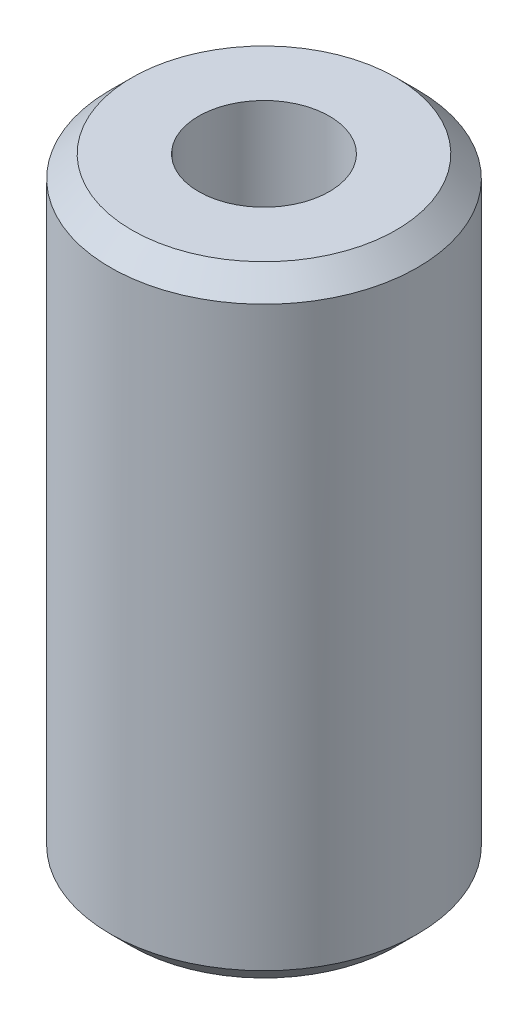
ISO-10303-21;
HEADER;
FILE_DESCRIPTION(('STEP AP214'),'2;1');
FILE_NAME('part.step','',(''),(''),'','','');
FILE_SCHEMA(('AUTOMOTIVE_DESIGN { 1 0 10303 214 1 1 1 1 }'));
ENDSEC;
DATA;
#1=APPLICATION_CONTEXT('core data for automotive mechanical design processes');
#2=APPLICATION_PROTOCOL_DEFINITION('international standard','automotive_design',2000,#1);
#3=PRODUCT_CONTEXT('',#1,'mechanical');
#4=PRODUCT('Part','Part','',(#3));
#5=PRODUCT_RELATED_PRODUCT_CATEGORY('part','',(#4));
#6=PRODUCT_DEFINITION_FORMATION('','',#4);
#7=PRODUCT_DEFINITION_CONTEXT('part definition',#1,'design');
#8=PRODUCT_DEFINITION('design','',#6,#7);
#9=PRODUCT_DEFINITION_SHAPE('','',#8);
#10=(LENGTH_UNIT() NAMED_UNIT(*) SI_UNIT(.MILLI.,.METRE.));
#11=(NAMED_UNIT(*) PLANE_ANGLE_UNIT() SI_UNIT($,.RADIAN.));
#12=(NAMED_UNIT(*) SI_UNIT($,.STERADIAN.) SOLID_ANGLE_UNIT());
#13=UNCERTAINTY_MEASURE_WITH_UNIT(LENGTH_MEASURE(1.E-05),#10,'distance_accuracy_value','');
#14=(GEOMETRIC_REPRESENTATION_CONTEXT(3) GLOBAL_UNCERTAINTY_ASSIGNED_CONTEXT((#13)) GLOBAL_UNIT_ASSIGNED_CONTEXT((#10,
#11,#12)) REPRESENTATION_CONTEXT('',''));
#15=CARTESIAN_POINT('',(0.,0.,0.));
#16=DIRECTION('',(0.,0.,1.));
#17=DIRECTION('',(1.,0.,0.));
#18=AXIS2_PLACEMENT_3D('',#15,#16,#17);
#19=CARTESIAN_POINT('',(0.,110.983095502342,0.));
#20=DIRECTION('',(0.,-1.,0.));
#21=DIRECTION('',(0.,0.,-1.));
#22=AXIS2_PLACEMENT_3D('',#19,#20,#21);
#23=CYLINDRICAL_SURFACE('',#22,27.5);
#24=CARTESIAN_POINT('',(0.,107.122272071481,0.));
#25=DIRECTION('',(0.,1.,0.));
#26=DIRECTION('',(0.,0.,1.));
#27=AXIS2_PLACEMENT_3D('',#24,#25,#26);
#28=CIRCLE('',#27,27.5);
#29=CARTESIAN_POINT('',(0.,107.122272071481,-27.5));
#30=VERTEX_POINT('',#29);
#31=EDGE_CURVE('E50',#30,#30,#28,.F.);
#32=ORIENTED_EDGE('',*,*,#31,.T.);
#33=EDGE_LOOP('',(#32));
#34=FACE_BOUND('',#33,.T.);
#35=CARTESIAN_POINT('',(0.,3.86082343086064,0.));
#36=DIRECTION('',(0.,1.,0.));
#37=DIRECTION('',(0.,0.,1.));
#38=AXIS2_PLACEMENT_3D('',#35,#36,#37);
#39=CIRCLE('',#38,27.5);
#40=CARTESIAN_POINT('',(0.,3.86082343086064,27.5));
#41=VERTEX_POINT('',#40);
#42=EDGE_CURVE('E51',#41,#41,#39,.T.);
#43=ORIENTED_EDGE('',*,*,#42,.T.);
#44=EDGE_LOOP('',(#43));
#45=FACE_BOUND('',#44,.T.);
#46=ADVANCED_FACE('F39',(#34,#45),#23,.T.);
#47=CARTESIAN_POINT('',(0.,110.983095502342,0.));
#48=DIRECTION('',(0.,1.,0.));
#49=DIRECTION('',(0.,0.,1.));
#50=AXIS2_PLACEMENT_3D('',#47,#48,#49);
#51=PLANE('',#50);
#52=CARTESIAN_POINT('',(0.,110.983095502342,0.));
#53=DIRECTION('',(0.,1.,0.));
#54=DIRECTION('',(0.,0.,1.));
#55=AXIS2_PLACEMENT_3D('',#52,#53,#54);
#56=CIRCLE('',#55,23.6391765691393);
#57=CARTESIAN_POINT('',(0.,110.983095502342,-23.6391765691394));
#58=VERTEX_POINT('',#57);
#59=EDGE_CURVE('E54',#58,#58,#56,.T.);
#60=ORIENTED_EDGE('',*,*,#59,.T.);
#61=EDGE_LOOP('',(#60));
#62=FACE_BOUND('',#61,.T.);
#63=CARTESIAN_POINT('',(0.,110.983095502342,0.));
#64=DIRECTION('',(0.,1.,0.));
#65=DIRECTION('',(0.,0.,1.));
#66=AXIS2_PLACEMENT_3D('',#63,#64,#65);
#67=CIRCLE('',#66,11.7006870520108);
#68=CARTESIAN_POINT('',(0.,110.983095502342,11.7006870520108));
#69=VERTEX_POINT('',#68);
#70=EDGE_CURVE('E58',#69,#69,#67,.T.);
#71=ORIENTED_EDGE('',*,*,#70,.F.);
#72=EDGE_LOOP('',(#71));
#73=FACE_BOUND('',#72,.T.);
#74=ADVANCED_FACE('F69',(#62,#73),#51,.T.);
#75=CARTESIAN_POINT('',(0.,0.,0.));
#76=DIRECTION('',(0.,1.,0.));
#77=DIRECTION('',(0.,0.,1.));
#78=AXIS2_PLACEMENT_3D('',#75,#76,#77);
#79=PLANE('',#78);
#80=CARTESIAN_POINT('',(0.,0.,0.));
#81=DIRECTION('',(0.,1.,0.));
#82=DIRECTION('',(0.,0.,1.));
#83=AXIS2_PLACEMENT_3D('',#80,#81,#82);
#84=CIRCLE('',#83,23.6391765691393);
#85=CARTESIAN_POINT('',(0.,0.,23.6391765691393));
#86=VERTEX_POINT('',#85);
#87=EDGE_CURVE('E10',#86,#86,#84,.F.);
#88=ORIENTED_EDGE('',*,*,#87,.T.);
#89=EDGE_LOOP('',(#88));
#90=FACE_BOUND('',#89,.T.);
#91=CARTESIAN_POINT('',(0.,0.,0.));
#92=DIRECTION('',(0.,1.,0.));
#93=DIRECTION('',(0.,0.,1.));
#94=AXIS2_PLACEMENT_3D('',#91,#92,#93);
#95=CIRCLE('',#94,11.7006870520108);
#96=CARTESIAN_POINT('',(0.,0.,11.7006870520108));
#97=VERTEX_POINT('',#96);
#98=EDGE_CURVE('E63',#97,#97,#95,.T.);
#99=ORIENTED_EDGE('',*,*,#98,.T.);
#100=EDGE_LOOP('',(#99));
#101=FACE_BOUND('',#100,.T.);
#102=ADVANCED_FACE('F75',(#90,#101),#79,.F.);
#103=CARTESIAN_POINT('',(0.,110.983095502342,0.));
#104=DIRECTION('',(0.,-1.,0.));
#105=DIRECTION('',(0.,0.,-1.));
#106=AXIS2_PLACEMENT_3D('',#103,#104,#105);
#107=CYLINDRICAL_SURFACE('',#106,11.7006870520108);
#108=ORIENTED_EDGE('',*,*,#70,.T.);
#109=EDGE_LOOP('',(#108));
#110=FACE_BOUND('',#109,.T.);
#111=ORIENTED_EDGE('',*,*,#98,.F.);
#112=EDGE_LOOP('',(#111));
#113=FACE_BOUND('',#112,.T.);
#114=ADVANCED_FACE('F70',(#110,#113),#107,.F.);
#115=CARTESIAN_POINT('',(0.,110.983095502342,0.));
#116=DIRECTION('',(0.,-1.,0.));
#117=DIRECTION('',(0.,0.,-1.));
#118=AXIS2_PLACEMENT_3D('',#115,#116,#117);
#119=CONICAL_SURFACE('',#118,23.6391765691393,0.785398163397443);
#120=CARTESIAN_POINT('',(0.,107.122272071481,-27.5));
#121=CARTESIAN_POINT('',(0.,107.162488982219,-27.4597830892619));
#122=CARTESIAN_POINT('',(0.,107.202705892957,-27.4195661785237));
#123=CARTESIAN_POINT('',(0.,107.283139714433,-27.3391323570475));
#124=CARTESIAN_POINT('',(0.,107.323356625172,-27.2989154463094));
#125=CARTESIAN_POINT('',(0.,107.403790446648,-27.2184816248331));
#126=CARTESIAN_POINT('',(0.,107.444007357386,-27.178264714095));
#127=CARTESIAN_POINT('',(0.,107.524441178862,-27.0978308926187));
#128=CARTESIAN_POINT('',(0.,107.5646580896,-27.0576139818806));
#129=CARTESIAN_POINT('',(0.,107.645091911077,-26.9771801604043));
#130=CARTESIAN_POINT('',(0.,107.685308821815,-26.9369632496662));
#131=CARTESIAN_POINT('',(0.,107.765742643291,-26.8565294281899));
#132=CARTESIAN_POINT('',(0.,107.805959554029,-26.8163125174518));
#133=CARTESIAN_POINT('',(0.,107.886393375505,-26.7358786959755));
#134=CARTESIAN_POINT('',(0.,107.926610286244,-26.6956617852374));
#135=CARTESIAN_POINT('',(0.,108.00704410772,-26.6152279637611));
#136=CARTESIAN_POINT('',(0.,108.047261018458,-26.575011053023));
#137=CARTESIAN_POINT('',(0.,108.127694839934,-26.4945772315467));
#138=CARTESIAN_POINT('',(0.,108.167911750672,-26.4543603208086));
#139=CARTESIAN_POINT('',(0.,108.248345572149,-26.3739264993323));
#140=CARTESIAN_POINT('',(0.,108.288562482887,-26.3337095885942));
#141=CARTESIAN_POINT('',(0.,108.368996304363,-26.2532757671179));
#142=CARTESIAN_POINT('',(0.,108.409213215101,-26.2130588563798));
#143=CARTESIAN_POINT('',(0.,108.489647036577,-26.1326250349035));
#144=CARTESIAN_POINT('',(0.,108.529863947316,-26.0924081241654));
#145=CARTESIAN_POINT('',(0.,108.610297768792,-26.0119743026891));
#146=CARTESIAN_POINT('',(0.,108.65051467953,-25.971757391951));
#147=CARTESIAN_POINT('',(0.,108.730948501006,-25.8913235704747));
#148=CARTESIAN_POINT('',(0.,108.771165411744,-25.8511066597366));
#149=CARTESIAN_POINT('',(0.,108.851599233221,-25.7706728382603));
#150=CARTESIAN_POINT('',(0.,108.891816143959,-25.7304559275222));
#151=CARTESIAN_POINT('',(0.,108.972249965435,-25.6500221060459));
#152=CARTESIAN_POINT('',(0.,109.012466876173,-25.6098051953078));
#153=CARTESIAN_POINT('',(0.,109.092900697649,-25.5293713738316));
#154=CARTESIAN_POINT('',(0.,109.133117608388,-25.4891544630934));
#155=CARTESIAN_POINT('',(0.,109.213551429864,-25.4087206416172));
#156=CARTESIAN_POINT('',(0.,109.253768340602,-25.368503730879));
#157=CARTESIAN_POINT('',(0.,109.334202162078,-25.2880699094028));
#158=CARTESIAN_POINT('',(0.,109.374419072816,-25.2478529986646));
#159=CARTESIAN_POINT('',(0.,109.454852894293,-25.1674191771884));
#160=CARTESIAN_POINT('',(0.,109.495069805031,-25.1272022664502));
#161=CARTESIAN_POINT('',(0.,109.575503626507,-25.046768444974));
#162=CARTESIAN_POINT('',(0.,109.615720537245,-25.0065515342358));
#163=CARTESIAN_POINT('',(0.,109.696154358721,-24.9261177127596));
#164=CARTESIAN_POINT('',(0.,109.73637126946,-24.8859008020214));
#165=CARTESIAN_POINT('',(0.,109.816805090936,-24.8054669805452));
#166=CARTESIAN_POINT('',(0.,109.857022001674,-24.765250069807));
#167=CARTESIAN_POINT('',(0.,109.93745582315,-24.6848162483308));
#168=CARTESIAN_POINT('',(0.,109.977672733888,-24.6445993375927));
#169=CARTESIAN_POINT('',(0.,110.058106555365,-24.5641655161164));
#170=CARTESIAN_POINT('',(0.,110.098323466103,-24.5239486053783));
#171=CARTESIAN_POINT('',(0.,110.178757287579,-24.443514783902));
#172=CARTESIAN_POINT('',(0.,110.218974198317,-24.4032978731639));
#173=CARTESIAN_POINT('',(0.,110.299408019793,-24.3228640516876));
#174=CARTESIAN_POINT('',(0.,110.339624930532,-24.2826471409495));
#175=CARTESIAN_POINT('',(0.,110.420058752008,-24.2022133194732));
#176=CARTESIAN_POINT('',(0.,110.460275662746,-24.1619964087351));
#177=CARTESIAN_POINT('',(0.,110.540709484222,-24.0815625872588));
#178=CARTESIAN_POINT('',(0.,110.58092639496,-24.0413456765207));
#179=CARTESIAN_POINT('',(0.,110.661360216437,-23.9609118550444));
#180=CARTESIAN_POINT('',(0.,110.701577127175,-23.9206949443063));
#181=CARTESIAN_POINT('',(0.,110.782010948651,-23.84026112283));
#182=CARTESIAN_POINT('',(0.,110.822227859389,-23.8000442120919));
#183=CARTESIAN_POINT('',(0.,110.902661680865,-23.7196103906156));
#184=CARTESIAN_POINT('',(0.,110.942878591604,-23.6793934798775));
#185=CARTESIAN_POINT('',(0.,110.983095502342,-23.6391765691394));
#186=B_SPLINE_CURVE_WITH_KNOTS('',3,(#120,#121,#122,#123,#124,#125,#126,#127,#128,#129,#130,
#131,#132,#133,#134,#135,#136,#137,#138,#139,#140,#141,#142,#143,#144,#145,#146,#147,#148,#149,
#150,#151,#152,#153,#154,#155,#156,#157,#158,#159,#160,#161,#162,#163,#164,#165,#166,#167,#168,
#169,#170,#171,#172,#173,#174,#175,#176,#177,#178,#179,#180,#181,#182,#183,#184,#185),
.UNSPECIFIED.,.F.,.F.,(4,2,2,2,2,2,2,2,2,2,2,2,2,2,2,2,2,2,2,2,2,2,2,2,2,2,2,2,2,2,2,2,4),(0.,
0.170625901807837,0.341251803615681,0.511877705423528,0.682503607231375,0.853129509039209,
1.02375541084706,1.1943813126549,1.36500721446275,1.53563311627058,1.70625901807843,
1.87688491988627,2.04751082169412,2.21813672350196,2.3887626253098,2.55938852711765,
2.73001442892549,2.90064033073333,3.07126623254118,3.24189213434902,3.41251803615687,
3.58314393796471,3.75376983977255,3.9243957415804,4.09502164338824,4.26564754519608,
4.43627344700393,4.60689934881177,4.77752525061962,4.94815115242745,5.1187770542353,
5.28940295604314,5.46002885785099),.UNSPECIFIED.);
#187=EDGE_CURVE('BSEAM81',#30,#58,#186,.T.);
#188=ORIENTED_EDGE('',*,*,#31,.F.);
#189=ORIENTED_EDGE('',*,*,#59,.F.);
#190=ORIENTED_EDGE('',*,*,#187,.T.);
#191=ORIENTED_EDGE('',*,*,#187,.F.);
#192=EDGE_LOOP('',(#188,#190,#189,#191));
#193=FACE_BOUND('',#192,.T.);
#194=ADVANCED_FACE('F81',(#193),#119,.T.);
#195=CARTESIAN_POINT('',(0.,3.86082343086064,0.));
#196=DIRECTION('',(0.,1.,0.));
#197=DIRECTION('',(0.,0.,1.));
#198=AXIS2_PLACEMENT_3D('',#195,#196,#197);
#199=CONICAL_SURFACE('',#198,27.5,0.785398163397453);
#200=ORIENTED_EDGE('',*,*,#87,.F.);
#201=EDGE_LOOP('',(#200));
#202=FACE_BOUND('',#201,.T.);
#203=ORIENTED_EDGE('',*,*,#42,.F.);
#204=EDGE_LOOP('',(#203));
#205=FACE_BOUND('',#204,.T.);
#206=ADVANCED_FACE('F45',(#202,#205),#199,.T.);
#207=CLOSED_SHELL('',(#46,#74,#102,#114,#194,#206));
#208=MANIFOLD_SOLID_BREP('B2',#207);
#209=ADVANCED_BREP_SHAPE_REPRESENTATION('',(#18,#208),#14);
#210=SHAPE_DEFINITION_REPRESENTATION(#9,#209);
ENDSEC;
END-ISO-10303-21;
